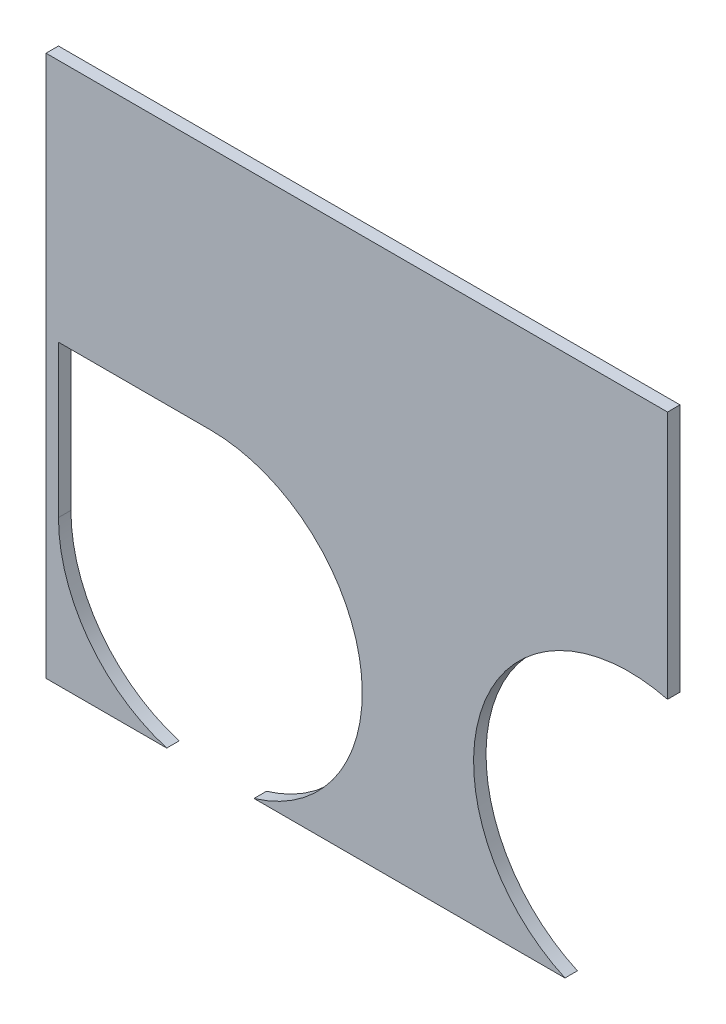
ISO-10303-21;
HEADER;
FILE_DESCRIPTION(('STEP AP214'),'2;1');
FILE_NAME('part.step','',(''),(''),'','','');
FILE_SCHEMA(('AUTOMOTIVE_DESIGN { 1 0 10303 214 1 1 1 1 }'));
ENDSEC;
DATA;
#1=APPLICATION_CONTEXT('core data for automotive mechanical design processes');
#2=APPLICATION_PROTOCOL_DEFINITION('international standard','automotive_design',2000,#1);
#3=PRODUCT_CONTEXT('',#1,'mechanical');
#4=PRODUCT('Part','Part','',(#3));
#5=PRODUCT_RELATED_PRODUCT_CATEGORY('part','',(#4));
#6=PRODUCT_DEFINITION_FORMATION('','',#4);
#7=PRODUCT_DEFINITION_CONTEXT('part definition',#1,'design');
#8=PRODUCT_DEFINITION('design','',#6,#7);
#9=PRODUCT_DEFINITION_SHAPE('','',#8);
#10=(LENGTH_UNIT() NAMED_UNIT(*) SI_UNIT(.MILLI.,.METRE.));
#11=(NAMED_UNIT(*) PLANE_ANGLE_UNIT() SI_UNIT($,.RADIAN.));
#12=(NAMED_UNIT(*) SI_UNIT($,.STERADIAN.) SOLID_ANGLE_UNIT());
#13=UNCERTAINTY_MEASURE_WITH_UNIT(LENGTH_MEASURE(1.E-05),#10,'distance_accuracy_value','');
#14=(GEOMETRIC_REPRESENTATION_CONTEXT(3) GLOBAL_UNCERTAINTY_ASSIGNED_CONTEXT((#13)) GLOBAL_UNIT_ASSIGNED_CONTEXT((#10,
#11,#12)) REPRESENTATION_CONTEXT('',''));
#15=CARTESIAN_POINT('',(0.,0.,0.));
#16=DIRECTION('',(0.,0.,1.));
#17=DIRECTION('',(1.,0.,0.));
#18=AXIS2_PLACEMENT_3D('',#15,#16,#17);
#19=CARTESIAN_POINT('',(0.,0.,5.));
#20=DIRECTION('',(1.,0.,0.));
#21=DIRECTION('',(0.,1.,0.));
#22=AXIS2_PLACEMENT_3D('',#19,#20,#21);
#23=PLANE('',#22);
#24=DIRECTION('',(0.,-1.,0.));
#25=VECTOR('',#24,1.);
#26=CARTESIAN_POINT('',(0.,0.,0.));
#27=LINE('',#26,#25);
#28=CARTESIAN_POINT('',(0.,0.,0.));
#29=VERTEX_POINT('',#28);
#30=CARTESIAN_POINT('',(0.,-217.428498097894,0.));
#31=VERTEX_POINT('',#30);
#32=EDGE_CURVE('E84',#29,#31,#27,.T.);
#33=ORIENTED_EDGE('',*,*,#32,.T.);
#34=DIRECTION('',(0.,0.,1.));
#35=VECTOR('',#34,1.);
#36=CARTESIAN_POINT('',(0.,-217.428498097894,0.));
#37=LINE('',#36,#35);
#38=CARTESIAN_POINT('',(0.,-217.428498097894,5.));
#39=VERTEX_POINT('',#38);
#40=EDGE_CURVE('E90',#31,#39,#37,.T.);
#41=ORIENTED_EDGE('',*,*,#40,.T.);
#42=DIRECTION('',(0.,-1.,0.));
#43=VECTOR('',#42,1.);
#44=CARTESIAN_POINT('',(0.,0.,5.));
#45=LINE('',#44,#43);
#46=CARTESIAN_POINT('',(0.,0.,5.));
#47=VERTEX_POINT('',#46);
#48=EDGE_CURVE('E78',#47,#39,#45,.T.);
#49=ORIENTED_EDGE('',*,*,#48,.F.);
#50=DIRECTION('',(0.,0.,-1.));
#51=VECTOR('',#50,1.);
#52=CARTESIAN_POINT('',(0.,0.,5.));
#53=LINE('',#52,#51);
#54=EDGE_CURVE('E42',#47,#29,#53,.T.);
#55=ORIENTED_EDGE('',*,*,#54,.T.);
#56=EDGE_LOOP('',(#33,#41,#49,#55));
#57=FACE_BOUND('',#56,.T.);
#58=ADVANCED_FACE('F35',(#57),#23,.F.);
#59=CARTESIAN_POINT('',(249.6,0.,5.));
#60=DIRECTION('',(-1.,0.,0.));
#61=DIRECTION('',(0.,-1.,0.));
#62=AXIS2_PLACEMENT_3D('',#59,#60,#61);
#63=PLANE('',#62);
#64=DIRECTION('',(0.,1.,0.));
#65=VECTOR('',#64,1.);
#66=CARTESIAN_POINT('',(249.6,0.,5.));
#67=LINE('',#66,#65);
#68=CARTESIAN_POINT('',(249.6,-99.9254641593209,5.));
#69=VERTEX_POINT('',#68);
#70=CARTESIAN_POINT('',(249.6,0.,5.));
#71=VERTEX_POINT('',#70);
#72=EDGE_CURVE('E97',#69,#71,#67,.T.);
#73=ORIENTED_EDGE('',*,*,#72,.F.);
#74=DIRECTION('',(0.,0.,1.));
#75=VECTOR('',#74,1.);
#76=CARTESIAN_POINT('',(249.6,-99.9254641593209,0.));
#77=LINE('',#76,#75);
#78=CARTESIAN_POINT('',(249.6,-99.9254641593209,0.));
#79=VERTEX_POINT('',#78);
#80=EDGE_CURVE('E100',#79,#69,#77,.T.);
#81=ORIENTED_EDGE('',*,*,#80,.F.);
#82=DIRECTION('',(0.,1.,0.));
#83=VECTOR('',#82,1.);
#84=CARTESIAN_POINT('',(249.6,0.,0.));
#85=LINE('',#84,#83);
#86=CARTESIAN_POINT('',(249.6,0.,0.));
#87=VERTEX_POINT('',#86);
#88=EDGE_CURVE('E79',#79,#87,#85,.T.);
#89=ORIENTED_EDGE('',*,*,#88,.T.);
#90=DIRECTION('',(0.,0.,-1.));
#91=VECTOR('',#90,1.);
#92=CARTESIAN_POINT('',(249.6,0.,5.));
#93=LINE('',#92,#91);
#94=EDGE_CURVE('E11',#71,#87,#93,.T.);
#95=ORIENTED_EDGE('',*,*,#94,.F.);
#96=EDGE_LOOP('',(#73,#81,#89,#95));
#97=FACE_BOUND('',#96,.T.);
#98=ADVANCED_FACE('F167',(#97),#63,.F.);
#99=CARTESIAN_POINT('',(0.,0.,5.));
#100=DIRECTION('',(0.,-1.,0.));
#101=DIRECTION('',(1.,0.,0.));
#102=AXIS2_PLACEMENT_3D('',#99,#100,#101);
#103=PLANE('',#102);
#104=DIRECTION('',(-1.,0.,0.));
#105=VECTOR('',#104,1.);
#106=CARTESIAN_POINT('',(0.,0.,0.));
#107=LINE('',#106,#105);
#108=EDGE_CURVE('E70',#87,#29,#107,.T.);
#109=ORIENTED_EDGE('',*,*,#108,.T.);
#110=ORIENTED_EDGE('',*,*,#54,.F.);
#111=DIRECTION('',(-1.,0.,0.));
#112=VECTOR('',#111,1.);
#113=CARTESIAN_POINT('',(0.,0.,5.));
#114=LINE('',#113,#112);
#115=EDGE_CURVE('E58',#71,#47,#114,.T.);
#116=ORIENTED_EDGE('',*,*,#115,.F.);
#117=ORIENTED_EDGE('',*,*,#94,.T.);
#118=EDGE_LOOP('',(#109,#110,#116,#117));
#119=FACE_BOUND('',#118,.T.);
#120=ADVANCED_FACE('F72',(#119),#103,.F.);
#121=CARTESIAN_POINT('',(0.,0.,5.));
#122=DIRECTION('',(0.,0.,1.));
#123=DIRECTION('',(1.,0.,0.));
#124=AXIS2_PLACEMENT_3D('',#121,#122,#123);
#125=PLANE('',#124);
#126=DIRECTION('',(-1.,0.,0.));
#127=VECTOR('',#126,1.);
#128=CARTESIAN_POINT('',(48.4754283925588,-217.428498097894,5.));
#129=LINE('',#128,#127);
#130=CARTESIAN_POINT('',(48.4754283925588,-217.428498097894,5.));
#131=VERTEX_POINT('',#130);
#132=EDGE_CURVE('E119',#131,#39,#129,.T.);
#133=ORIENTED_EDGE('',*,*,#132,.F.);
#134=CARTESIAN_POINT('',(66.0000000000002,-159.,5.));
#135=DIRECTION('',(0.,0.,1.));
#136=DIRECTION('',(1.,0.,0.));
#137=AXIS2_PLACEMENT_3D('',#134,#135,#136);
#138=CIRCLE('',#137,61.);
#139=CARTESIAN_POINT('',(5.0000000000002,-159.,5.));
#140=VERTEX_POINT('',#139);
#141=EDGE_CURVE('E123',#140,#131,#138,.T.);
#142=ORIENTED_EDGE('',*,*,#141,.F.);
#143=DIRECTION('',(0.,-1.,0.));
#144=VECTOR('',#143,1.);
#145=CARTESIAN_POINT('',(5.0000000000002,-159.,5.));
#146=LINE('',#145,#144);
#147=CARTESIAN_POINT('',(5.00000000000018,-98.,5.));
#148=VERTEX_POINT('',#147);
#149=EDGE_CURVE('E126',#148,#140,#146,.T.);
#150=ORIENTED_EDGE('',*,*,#149,.F.);
#151=DIRECTION('',(-1.,0.,0.));
#152=VECTOR('',#151,1.);
#153=CARTESIAN_POINT('',(66.0000000000002,-98.,5.));
#154=LINE('',#153,#152);
#155=CARTESIAN_POINT('',(66.0000000000002,-98.,5.));
#156=VERTEX_POINT('',#155);
#157=EDGE_CURVE('E129',#156,#148,#154,.T.);
#158=ORIENTED_EDGE('',*,*,#157,.F.);
#159=CARTESIAN_POINT('',(66.0000000000002,-159.,5.));
#160=DIRECTION('',(0.,0.,1.));
#161=DIRECTION('',(1.,0.,0.));
#162=AXIS2_PLACEMENT_3D('',#159,#160,#161);
#163=CIRCLE('',#162,61.);
#164=CARTESIAN_POINT('',(83.5245716074416,-217.428498097894,5.));
#165=VERTEX_POINT('',#164);
#166=EDGE_CURVE('E132',#165,#156,#163,.T.);
#167=ORIENTED_EDGE('',*,*,#166,.F.);
#168=DIRECTION('',(-1.,0.,0.));
#169=VECTOR('',#168,1.);
#170=CARTESIAN_POINT('',(208.410715021119,-217.428498097894,5.));
#171=LINE('',#170,#169);
#172=CARTESIAN_POINT('',(208.410715021119,-217.428498097894,5.));
#173=VERTEX_POINT('',#172);
#174=EDGE_CURVE('E135',#173,#165,#171,.T.);
#175=ORIENTED_EDGE('',*,*,#174,.F.);
#176=CARTESIAN_POINT('',(234.205987927565,-160.5,5.));
#177=DIRECTION('',(0.,0.,1.));
#178=DIRECTION('',(1.,0.,0.));
#179=AXIS2_PLACEMENT_3D('',#176,#177,#178);
#180=CIRCLE('',#179,62.5);
#181=EDGE_CURVE('E138',#69,#173,#180,.T.);
#182=ORIENTED_EDGE('',*,*,#181,.F.);
#183=ORIENTED_EDGE('',*,*,#72,.T.);
#184=ORIENTED_EDGE('',*,*,#115,.T.);
#185=ORIENTED_EDGE('',*,*,#48,.T.);
#186=EDGE_LOOP('',(#133,#142,#150,#158,#167,#175,#182,#183,#184,#185));
#187=FACE_BOUND('',#186,.T.);
#188=ADVANCED_FACE('F171',(#187),#125,.T.);
#189=CARTESIAN_POINT('',(0.,0.,0.));
#190=DIRECTION('',(0.,0.,1.));
#191=DIRECTION('',(1.,0.,0.));
#192=AXIS2_PLACEMENT_3D('',#189,#190,#191);
#193=PLANE('',#192);
#194=CARTESIAN_POINT('',(66.0000000000002,-159.,0.));
#195=DIRECTION('',(0.,0.,1.));
#196=DIRECTION('',(1.,0.,0.));
#197=AXIS2_PLACEMENT_3D('',#194,#195,#196);
#198=CIRCLE('',#197,61.);
#199=CARTESIAN_POINT('',(5.0000000000002,-159.,0.));
#200=VERTEX_POINT('',#199);
#201=CARTESIAN_POINT('',(48.4754283925588,-217.428498097894,0.));
#202=VERTEX_POINT('',#201);
#203=EDGE_CURVE('E142',#200,#202,#198,.T.);
#204=ORIENTED_EDGE('',*,*,#203,.T.);
#205=DIRECTION('',(-1.,0.,0.));
#206=VECTOR('',#205,1.);
#207=CARTESIAN_POINT('',(48.4754283925588,-217.428498097894,0.));
#208=LINE('',#207,#206);
#209=EDGE_CURVE('E89',#202,#31,#208,.T.);
#210=ORIENTED_EDGE('',*,*,#209,.T.);
#211=ORIENTED_EDGE('',*,*,#32,.F.);
#212=ORIENTED_EDGE('',*,*,#108,.F.);
#213=ORIENTED_EDGE('',*,*,#88,.F.);
#214=CARTESIAN_POINT('',(234.205987927565,-160.5,0.));
#215=DIRECTION('',(0.,0.,1.));
#216=DIRECTION('',(1.,0.,0.));
#217=AXIS2_PLACEMENT_3D('',#214,#215,#216);
#218=CIRCLE('',#217,62.5);
#219=CARTESIAN_POINT('',(208.410715021119,-217.428498097894,0.));
#220=VERTEX_POINT('',#219);
#221=EDGE_CURVE('E122',#79,#220,#218,.T.);
#222=ORIENTED_EDGE('',*,*,#221,.T.);
#223=DIRECTION('',(-1.,0.,0.));
#224=VECTOR('',#223,1.);
#225=CARTESIAN_POINT('',(208.410715021119,-217.428498097894,0.));
#226=LINE('',#225,#224);
#227=CARTESIAN_POINT('',(83.5245716074416,-217.428498097894,0.));
#228=VERTEX_POINT('',#227);
#229=EDGE_CURVE('E49',#220,#228,#226,.T.);
#230=ORIENTED_EDGE('',*,*,#229,.T.);
#231=CARTESIAN_POINT('',(66.0000000000002,-159.,0.));
#232=DIRECTION('',(0.,0.,1.));
#233=DIRECTION('',(1.,0.,0.));
#234=AXIS2_PLACEMENT_3D('',#231,#232,#233);
#235=CIRCLE('',#234,61.);
#236=CARTESIAN_POINT('',(66.0000000000002,-98.,0.));
#237=VERTEX_POINT('',#236);
#238=EDGE_CURVE('E150',#228,#237,#235,.T.);
#239=ORIENTED_EDGE('',*,*,#238,.T.);
#240=DIRECTION('',(-1.,0.,0.));
#241=VECTOR('',#240,1.);
#242=CARTESIAN_POINT('',(66.0000000000002,-98.,0.));
#243=LINE('',#242,#241);
#244=CARTESIAN_POINT('',(5.00000000000018,-98.,0.));
#245=VERTEX_POINT('',#244);
#246=EDGE_CURVE('E147',#237,#245,#243,.T.);
#247=ORIENTED_EDGE('',*,*,#246,.T.);
#248=DIRECTION('',(0.,-1.,0.));
#249=VECTOR('',#248,1.);
#250=CARTESIAN_POINT('',(5.0000000000002,-159.,0.));
#251=LINE('',#250,#249);
#252=EDGE_CURVE('E144',#245,#200,#251,.T.);
#253=ORIENTED_EDGE('',*,*,#252,.T.);
#254=EDGE_LOOP('',(#204,#210,#211,#212,#213,#222,#230,#239,#247,#253));
#255=FACE_BOUND('',#254,.T.);
#256=ADVANCED_FACE('F87',(#255),#193,.F.);
#257=CARTESIAN_POINT('',(48.4754283925588,-217.428498097894,0.));
#258=DIRECTION('',(0.,1.,0.));
#259=DIRECTION('',(-1.,0.,0.));
#260=AXIS2_PLACEMENT_3D('',#257,#258,#259);
#261=PLANE('',#260);
#262=ORIENTED_EDGE('',*,*,#132,.T.);
#263=ORIENTED_EDGE('',*,*,#40,.F.);
#264=ORIENTED_EDGE('',*,*,#209,.F.);
#265=DIRECTION('',(0.,0.,1.));
#266=VECTOR('',#265,1.);
#267=CARTESIAN_POINT('',(48.4754283925588,-217.428498097894,0.));
#268=LINE('',#267,#266);
#269=EDGE_CURVE('E93',#202,#131,#268,.T.);
#270=ORIENTED_EDGE('',*,*,#269,.T.);
#271=EDGE_LOOP('',(#262,#263,#264,#270));
#272=FACE_BOUND('',#271,.T.);
#273=ADVANCED_FACE('F188',(#272),#261,.F.);
#274=CARTESIAN_POINT('',(66.0000000000002,-159.,0.));
#275=DIRECTION('',(0.,0.,1.));
#276=DIRECTION('',(1.,0.,0.));
#277=AXIS2_PLACEMENT_3D('',#274,#275,#276);
#278=CYLINDRICAL_SURFACE('',#277,61.);
#279=ORIENTED_EDGE('',*,*,#141,.T.);
#280=ORIENTED_EDGE('',*,*,#269,.F.);
#281=ORIENTED_EDGE('',*,*,#203,.F.);
#282=DIRECTION('',(0.,0.,1.));
#283=VECTOR('',#282,1.);
#284=CARTESIAN_POINT('',(5.0000000000002,-159.,0.));
#285=LINE('',#284,#283);
#286=EDGE_CURVE('E114',#200,#140,#285,.T.);
#287=ORIENTED_EDGE('',*,*,#286,.T.);
#288=EDGE_LOOP('',(#279,#280,#281,#287));
#289=FACE_BOUND('',#288,.T.);
#290=ADVANCED_FACE('F194',(#289),#278,.F.);
#291=CARTESIAN_POINT('',(5.0000000000002,-159.,0.));
#292=DIRECTION('',(-1.,0.,0.));
#293=DIRECTION('',(0.,-1.,0.));
#294=AXIS2_PLACEMENT_3D('',#291,#292,#293);
#295=PLANE('',#294);
#296=ORIENTED_EDGE('',*,*,#149,.T.);
#297=ORIENTED_EDGE('',*,*,#286,.F.);
#298=ORIENTED_EDGE('',*,*,#252,.F.);
#299=DIRECTION('',(0.,0.,1.));
#300=VECTOR('',#299,1.);
#301=CARTESIAN_POINT('',(5.00000000000018,-98.,0.));
#302=LINE('',#301,#300);
#303=EDGE_CURVE('E111',#245,#148,#302,.T.);
#304=ORIENTED_EDGE('',*,*,#303,.T.);
#305=EDGE_LOOP('',(#296,#297,#298,#304));
#306=FACE_BOUND('',#305,.T.);
#307=ADVANCED_FACE('F201',(#306),#295,.F.);
#308=CARTESIAN_POINT('',(66.0000000000002,-98.,0.));
#309=DIRECTION('',(0.,1.,0.));
#310=DIRECTION('',(-1.,0.,0.));
#311=AXIS2_PLACEMENT_3D('',#308,#309,#310);
#312=PLANE('',#311);
#313=ORIENTED_EDGE('',*,*,#157,.T.);
#314=ORIENTED_EDGE('',*,*,#303,.F.);
#315=ORIENTED_EDGE('',*,*,#246,.F.);
#316=DIRECTION('',(0.,0.,1.));
#317=VECTOR('',#316,1.);
#318=CARTESIAN_POINT('',(66.0000000000002,-98.,0.));
#319=LINE('',#318,#317);
#320=EDGE_CURVE('E108',#237,#156,#319,.T.);
#321=ORIENTED_EDGE('',*,*,#320,.T.);
#322=EDGE_LOOP('',(#313,#314,#315,#321));
#323=FACE_BOUND('',#322,.T.);
#324=ADVANCED_FACE('F206',(#323),#312,.F.);
#325=CARTESIAN_POINT('',(66.0000000000002,-159.,0.));
#326=DIRECTION('',(0.,0.,1.));
#327=DIRECTION('',(1.,0.,0.));
#328=AXIS2_PLACEMENT_3D('',#325,#326,#327);
#329=CYLINDRICAL_SURFACE('',#328,61.);
#330=ORIENTED_EDGE('',*,*,#166,.T.);
#331=ORIENTED_EDGE('',*,*,#320,.F.);
#332=ORIENTED_EDGE('',*,*,#238,.F.);
#333=DIRECTION('',(0.,0.,1.));
#334=VECTOR('',#333,1.);
#335=CARTESIAN_POINT('',(83.5245716074416,-217.428498097894,0.));
#336=LINE('',#335,#334);
#337=EDGE_CURVE('E105',#228,#165,#336,.T.);
#338=ORIENTED_EDGE('',*,*,#337,.T.);
#339=EDGE_LOOP('',(#330,#331,#332,#338));
#340=FACE_BOUND('',#339,.T.);
#341=ADVANCED_FACE('F209',(#340),#329,.F.);
#342=CARTESIAN_POINT('',(208.410715021119,-217.428498097894,0.));
#343=DIRECTION('',(0.,1.,0.));
#344=DIRECTION('',(0.,0.,1.));
#345=AXIS2_PLACEMENT_3D('',#342,#343,#344);
#346=PLANE('',#345);
#347=ORIENTED_EDGE('',*,*,#174,.T.);
#348=ORIENTED_EDGE('',*,*,#337,.F.);
#349=ORIENTED_EDGE('',*,*,#229,.F.);
#350=DIRECTION('',(0.,0.,1.));
#351=VECTOR('',#350,1.);
#352=CARTESIAN_POINT('',(208.410715021119,-217.428498097894,0.));
#353=LINE('',#352,#351);
#354=EDGE_CURVE('E103',#220,#173,#353,.T.);
#355=ORIENTED_EDGE('',*,*,#354,.T.);
#356=EDGE_LOOP('',(#347,#348,#349,#355));
#357=FACE_BOUND('',#356,.T.);
#358=ADVANCED_FACE('F212',(#357),#346,.F.);
#359=CARTESIAN_POINT('',(234.205987927565,-160.5,0.));
#360=DIRECTION('',(0.,0.,1.));
#361=DIRECTION('',(1.,0.,0.));
#362=AXIS2_PLACEMENT_3D('',#359,#360,#361);
#363=CYLINDRICAL_SURFACE('',#362,62.5);
#364=ORIENTED_EDGE('',*,*,#181,.T.);
#365=ORIENTED_EDGE('',*,*,#354,.F.);
#366=ORIENTED_EDGE('',*,*,#221,.F.);
#367=ORIENTED_EDGE('',*,*,#80,.T.);
#368=EDGE_LOOP('',(#364,#365,#366,#367));
#369=FACE_BOUND('',#368,.T.);
#370=ADVANCED_FACE('F160',(#369),#363,.F.);
#371=CLOSED_SHELL('',(#58,#98,#120,#188,#256,#273,#290,#307,#324,#341,#358,#370));
#372=MANIFOLD_SOLID_BREP('B2',#371);
#373=ADVANCED_BREP_SHAPE_REPRESENTATION('',(#18,#372),#14);
#374=SHAPE_DEFINITION_REPRESENTATION(#9,#373);
ENDSEC;
END-ISO-10303-21;
